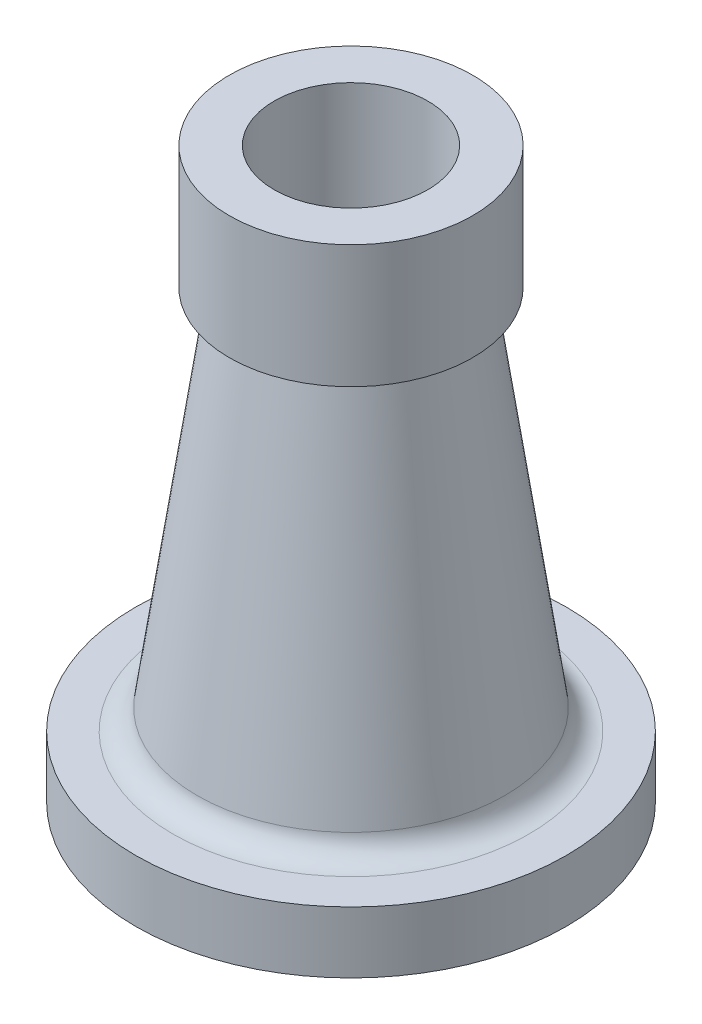
ISO-10303-21;
HEADER;
FILE_DESCRIPTION(('STEP AP214'),'2;1');
FILE_NAME('part.step','',(''),(''),'','','');
FILE_SCHEMA(('AUTOMOTIVE_DESIGN { 1 0 10303 214 1 1 1 1 }'));
ENDSEC;
DATA;
#1=APPLICATION_CONTEXT('core data for automotive mechanical design processes');
#2=APPLICATION_PROTOCOL_DEFINITION('international standard','automotive_design',2000,#1);
#3=PRODUCT_CONTEXT('',#1,'mechanical');
#4=PRODUCT('Part','Part','',(#3));
#5=PRODUCT_RELATED_PRODUCT_CATEGORY('part','',(#4));
#6=PRODUCT_DEFINITION_FORMATION('','',#4);
#7=PRODUCT_DEFINITION_CONTEXT('part definition',#1,'design');
#8=PRODUCT_DEFINITION('design','',#6,#7);
#9=PRODUCT_DEFINITION_SHAPE('','',#8);
#10=(LENGTH_UNIT() NAMED_UNIT(*) SI_UNIT(.MILLI.,.METRE.));
#11=(NAMED_UNIT(*) PLANE_ANGLE_UNIT() SI_UNIT($,.RADIAN.));
#12=(NAMED_UNIT(*) SI_UNIT($,.STERADIAN.) SOLID_ANGLE_UNIT());
#13=UNCERTAINTY_MEASURE_WITH_UNIT(LENGTH_MEASURE(1.E-05),#10,'distance_accuracy_value','');
#14=(GEOMETRIC_REPRESENTATION_CONTEXT(3) GLOBAL_UNCERTAINTY_ASSIGNED_CONTEXT((#13)) GLOBAL_UNIT_ASSIGNED_CONTEXT((#10,
#11,#12)) REPRESENTATION_CONTEXT('',''));
#15=CARTESIAN_POINT('',(0.,0.,0.));
#16=DIRECTION('',(0.,0.,1.));
#17=DIRECTION('',(1.,0.,0.));
#18=AXIS2_PLACEMENT_3D('',#15,#16,#17);
#19=CARTESIAN_POINT('',(0.,-96.2786807810246,0.));
#20=DIRECTION('',(0.,1.,0.));
#21=DIRECTION('',(0.,0.,1.));
#22=AXIS2_PLACEMENT_3D('',#19,#20,#21);
#23=TOROIDAL_SURFACE('',#22,57.9184382383119,7.99999999999999);
#24=CARTESIAN_POINT('',(0.,-97.4181262014115,0.));
#25=DIRECTION('',(0.,1.,0.));
#26=DIRECTION('',(0.,0.,1.));
#27=AXIS2_PLACEMENT_3D('',#24,#25,#26);
#28=CIRCLE('',#27,50.);
#29=CARTESIAN_POINT('',(0.,-97.4181262014115,50.));
#30=VERTEX_POINT('',#29);
#31=EDGE_CURVE('E77',#30,#30,#28,.T.);
#32=ORIENTED_EDGE('',*,*,#31,.F.);
#33=EDGE_LOOP('',(#32));
#34=FACE_BOUND('',#33,.T.);
#35=CARTESIAN_POINT('',(0.,-104.278680781025,0.));
#36=DIRECTION('',(0.,1.,0.));
#37=DIRECTION('',(0.,0.,1.));
#38=AXIS2_PLACEMENT_3D('',#35,#36,#37);
#39=CIRCLE('',#38,57.9184382383119);
#40=CARTESIAN_POINT('',(0.,-104.278680781025,57.9184382383119));
#41=VERTEX_POINT('',#40);
#42=EDGE_CURVE('E10',#41,#41,#39,.T.);
#43=ORIENTED_EDGE('',*,*,#42,.T.);
#44=EDGE_LOOP('',(#43));
#45=FACE_BOUND('',#44,.T.);
#46=ADVANCED_FACE('F31',(#34,#45),#23,.F.);
#47=CARTESIAN_POINT('',(57.9184382383119,-104.278680781025,0.));
#48=DIRECTION('',(0.,-1.,0.));
#49=DIRECTION('',(0.,0.,-1.));
#50=AXIS2_PLACEMENT_3D('',#47,#48,#49);
#51=PLANE('',#50);
#52=ORIENTED_EDGE('',*,*,#42,.F.);
#53=EDGE_LOOP('',(#52));
#54=FACE_BOUND('',#53,.T.);
#55=CARTESIAN_POINT('',(0.,-104.278680781025,0.));
#56=DIRECTION('',(0.,1.,0.));
#57=DIRECTION('',(0.,0.,1.));
#58=AXIS2_PLACEMENT_3D('',#55,#56,#57);
#59=CIRCLE('',#58,70.);
#60=CARTESIAN_POINT('',(0.,-104.278680781025,70.));
#61=VERTEX_POINT('',#60);
#62=EDGE_CURVE('E37',#61,#61,#59,.T.);
#63=ORIENTED_EDGE('',*,*,#62,.T.);
#64=EDGE_LOOP('',(#63));
#65=FACE_BOUND('',#64,.T.);
#66=ADVANCED_FACE('F84',(#54,#65),#51,.F.);
#67=CARTESIAN_POINT('',(0.,76.1737442525595,0.));
#68=DIRECTION('',(0.,1.,0.));
#69=DIRECTION('',(0.,0.,1.));
#70=AXIS2_PLACEMENT_3D('',#67,#68,#69);
#71=CYLINDRICAL_SURFACE('',#70,70.);
#72=ORIENTED_EDGE('',*,*,#62,.F.);
#73=EDGE_LOOP('',(#72));
#74=FACE_BOUND('',#73,.T.);
#75=CARTESIAN_POINT('',(0.,-124.278680781025,0.));
#76=DIRECTION('',(0.,1.,0.));
#77=DIRECTION('',(0.,0.,1.));
#78=AXIS2_PLACEMENT_3D('',#75,#76,#77);
#79=CIRCLE('',#78,70.);
#80=CARTESIAN_POINT('',(0.,-124.278680781025,70.));
#81=VERTEX_POINT('',#80);
#82=EDGE_CURVE('E41',#81,#81,#79,.T.);
#83=ORIENTED_EDGE('',*,*,#82,.T.);
#84=EDGE_LOOP('',(#83));
#85=FACE_BOUND('',#84,.T.);
#86=ADVANCED_FACE('F88',(#74,#85),#71,.T.);
#87=CARTESIAN_POINT('',(70.,-124.278680781025,0.));
#88=DIRECTION('',(0.,1.,0.));
#89=DIRECTION('',(0.,0.,1.));
#90=AXIS2_PLACEMENT_3D('',#87,#88,#89);
#91=PLANE('',#90);
#92=ORIENTED_EDGE('',*,*,#82,.F.);
#93=EDGE_LOOP('',(#92));
#94=FACE_BOUND('',#93,.T.);
#95=CARTESIAN_POINT('',(0.,-124.278680781025,0.));
#96=DIRECTION('',(0.,1.,0.));
#97=DIRECTION('',(0.,0.,1.));
#98=AXIS2_PLACEMENT_3D('',#95,#96,#97);
#99=CIRCLE('',#98,50.);
#100=CARTESIAN_POINT('',(0.,-124.278680781025,50.));
#101=VERTEX_POINT('',#100);
#102=EDGE_CURVE('E45',#101,#101,#99,.T.);
#103=ORIENTED_EDGE('',*,*,#102,.T.);
#104=EDGE_LOOP('',(#103));
#105=FACE_BOUND('',#104,.T.);
#106=ADVANCED_FACE('F93',(#94,#105),#91,.F.);
#107=CARTESIAN_POINT('',(0.,76.1737442525595,0.));
#108=DIRECTION('',(0.,1.,0.));
#109=DIRECTION('',(0.,0.,1.));
#110=AXIS2_PLACEMENT_3D('',#107,#108,#109);
#111=CYLINDRICAL_SURFACE('',#110,50.);
#112=ORIENTED_EDGE('',*,*,#102,.F.);
#113=EDGE_LOOP('',(#112));
#114=FACE_BOUND('',#113,.T.);
#115=CARTESIAN_POINT('',(0.,-122.278680781025,0.));
#116=DIRECTION('',(0.,1.,0.));
#117=DIRECTION('',(0.,0.,1.));
#118=AXIS2_PLACEMENT_3D('',#115,#116,#117);
#119=CIRCLE('',#118,50.);
#120=CARTESIAN_POINT('',(0.,-122.278680781025,50.));
#121=VERTEX_POINT('',#120);
#122=EDGE_CURVE('E50',#121,#121,#119,.T.);
#123=ORIENTED_EDGE('',*,*,#122,.T.);
#124=EDGE_LOOP('',(#123));
#125=FACE_BOUND('',#124,.T.);
#126=ADVANCED_FACE('F99',(#114,#125),#111,.F.);
#127=CARTESIAN_POINT('',(0.,-122.278680781025,0.));
#128=DIRECTION('',(0.,1.,0.));
#129=DIRECTION('',(0.,0.,1.));
#130=AXIS2_PLACEMENT_3D('',#127,#128,#129);
#131=TOROIDAL_SURFACE('',#130,49.,1.);
#132=ORIENTED_EDGE('',*,*,#122,.F.);
#133=EDGE_LOOP('',(#132));
#134=FACE_BOUND('',#133,.T.);
#135=CARTESIAN_POINT('',(0.,-121.278680781025,0.));
#136=DIRECTION('',(0.,1.,0.));
#137=DIRECTION('',(0.,0.,1.));
#138=AXIS2_PLACEMENT_3D('',#135,#136,#137);
#139=CIRCLE('',#138,49.);
#140=CARTESIAN_POINT('',(0.,-121.278680781025,49.));
#141=VERTEX_POINT('',#140);
#142=EDGE_CURVE('E53',#141,#141,#139,.T.);
#143=ORIENTED_EDGE('',*,*,#142,.T.);
#144=EDGE_LOOP('',(#143));
#145=FACE_BOUND('',#144,.T.);
#146=ADVANCED_FACE('F103',(#134,#145),#131,.F.);
#147=CARTESIAN_POINT('',(43.3304777069742,-121.278680781025,0.));
#148=DIRECTION('',(0.,1.,0.));
#149=DIRECTION('',(0.,0.,1.));
#150=AXIS2_PLACEMENT_3D('',#147,#148,#149);
#151=PLANE('',#150);
#152=ORIENTED_EDGE('',*,*,#142,.F.);
#153=EDGE_LOOP('',(#152));
#154=FACE_BOUND('',#153,.T.);
#155=CARTESIAN_POINT('',(0.,-121.278680781025,0.));
#156=DIRECTION('',(0.,1.,0.));
#157=DIRECTION('',(0.,0.,1.));
#158=AXIS2_PLACEMENT_3D('',#155,#156,#157);
#159=CIRCLE('',#158,43.3304777069742);
#160=CARTESIAN_POINT('',(0.,-121.278680781025,43.3304777069742));
#161=VERTEX_POINT('',#160);
#162=EDGE_CURVE('E56',#161,#161,#159,.T.);
#163=ORIENTED_EDGE('',*,*,#162,.T.);
#164=EDGE_LOOP('',(#163));
#165=FACE_BOUND('',#164,.T.);
#166=ADVANCED_FACE('F107',(#154,#165),#151,.F.);
#167=CARTESIAN_POINT('',(0.,6.10675866560406,0.));
#168=DIRECTION('',(0.,-1.,0.));
#169=DIRECTION('',(0.,0.,-1.));
#170=AXIS2_PLACEMENT_3D('',#167,#168,#169);
#171=CONICAL_SURFACE('',#170,25.,0.142916697533729);
#172=ORIENTED_EDGE('',*,*,#162,.F.);
#173=EDGE_LOOP('',(#172));
#174=FACE_BOUND('',#173,.T.);
#175=CARTESIAN_POINT('',(0.,6.10675866560406,0.));
#176=DIRECTION('',(0.,1.,0.));
#177=DIRECTION('',(0.,0.,1.));
#178=AXIS2_PLACEMENT_3D('',#175,#176,#177);
#179=CIRCLE('',#178,25.);
#180=CARTESIAN_POINT('',(0.,6.10675866560406,25.));
#181=VERTEX_POINT('',#180);
#182=EDGE_CURVE('E59',#181,#181,#179,.T.);
#183=ORIENTED_EDGE('',*,*,#182,.T.);
#184=EDGE_LOOP('',(#183));
#185=FACE_BOUND('',#184,.T.);
#186=ADVANCED_FACE('F111',(#174,#185),#171,.F.);
#187=CARTESIAN_POINT('',(0.,76.1737442525595,0.));
#188=DIRECTION('',(0.,1.,0.));
#189=DIRECTION('',(0.,0.,1.));
#190=AXIS2_PLACEMENT_3D('',#187,#188,#189);
#191=CYLINDRICAL_SURFACE('',#190,25.);
#192=ORIENTED_EDGE('',*,*,#182,.F.);
#193=EDGE_LOOP('',(#192));
#194=FACE_BOUND('',#193,.T.);
#195=CARTESIAN_POINT('',(0.,60.7213192189753,0.));
#196=DIRECTION('',(0.,1.,0.));
#197=DIRECTION('',(0.,0.,1.));
#198=AXIS2_PLACEMENT_3D('',#195,#196,#197);
#199=CIRCLE('',#198,25.);
#200=CARTESIAN_POINT('',(0.,60.7213192189753,25.));
#201=VERTEX_POINT('',#200);
#202=EDGE_CURVE('E62',#201,#201,#199,.T.);
#203=ORIENTED_EDGE('',*,*,#202,.T.);
#204=EDGE_LOOP('',(#203));
#205=FACE_BOUND('',#204,.T.);
#206=ADVANCED_FACE('F115',(#194,#205),#191,.F.);
#207=CARTESIAN_POINT('',(39.5878595746606,60.7213192189753,0.));
#208=DIRECTION('',(0.,-1.,0.));
#209=DIRECTION('',(0.,0.,-1.));
#210=AXIS2_PLACEMENT_3D('',#207,#208,#209);
#211=PLANE('',#210);
#212=ORIENTED_EDGE('',*,*,#202,.F.);
#213=EDGE_LOOP('',(#212));
#214=FACE_BOUND('',#213,.T.);
#215=CARTESIAN_POINT('',(0.,60.7213192189753,0.));
#216=DIRECTION('',(0.,1.,0.));
#217=DIRECTION('',(0.,0.,1.));
#218=AXIS2_PLACEMENT_3D('',#215,#216,#217);
#219=CIRCLE('',#218,39.5878595746606);
#220=CARTESIAN_POINT('',(0.,60.7213192189753,39.5878595746606));
#221=VERTEX_POINT('',#220);
#222=EDGE_CURVE('E65',#221,#221,#219,.T.);
#223=ORIENTED_EDGE('',*,*,#222,.T.);
#224=EDGE_LOOP('',(#223));
#225=FACE_BOUND('',#224,.T.);
#226=ADVANCED_FACE('F119',(#214,#225),#211,.F.);
#227=CARTESIAN_POINT('',(0.,76.1737442525595,0.));
#228=DIRECTION('',(0.,1.,0.));
#229=DIRECTION('',(0.,0.,1.));
#230=AXIS2_PLACEMENT_3D('',#227,#228,#229);
#231=CYLINDRICAL_SURFACE('',#230,39.5878595746607);
#232=ORIENTED_EDGE('',*,*,#222,.F.);
#233=EDGE_LOOP('',(#232));
#234=FACE_BOUND('',#233,.T.);
#235=CARTESIAN_POINT('',(0.,20.7213192189753,0.));
#236=DIRECTION('',(0.,1.,0.));
#237=DIRECTION('',(0.,0.,1.));
#238=AXIS2_PLACEMENT_3D('',#235,#236,#237);
#239=CIRCLE('',#238,39.5878595746607);
#240=CARTESIAN_POINT('',(0.,20.7213192189753,39.5878595746607));
#241=VERTEX_POINT('',#240);
#242=EDGE_CURVE('E68',#241,#241,#239,.T.);
#243=ORIENTED_EDGE('',*,*,#242,.T.);
#244=EDGE_LOOP('',(#243));
#245=FACE_BOUND('',#244,.T.);
#246=ADVANCED_FACE('F123',(#234,#245),#231,.T.);
#247=CARTESIAN_POINT('',(39.5878595746607,20.7213192189753,0.));
#248=DIRECTION('',(0.,1.,0.));
#249=DIRECTION('',(0.,0.,1.));
#250=AXIS2_PLACEMENT_3D('',#247,#248,#249);
#251=PLANE('',#250);
#252=ORIENTED_EDGE('',*,*,#242,.F.);
#253=EDGE_LOOP('',(#252));
#254=FACE_BOUND('',#253,.T.);
#255=CARTESIAN_POINT('',(0.,20.7213192189753,0.));
#256=DIRECTION('',(0.,1.,0.));
#257=DIRECTION('',(0.,0.,1.));
#258=AXIS2_PLACEMENT_3D('',#255,#256,#257);
#259=CIRCLE('',#258,34.1541979801228);
#260=CARTESIAN_POINT('',(0.,20.7213192189753,34.1541979801228));
#261=VERTEX_POINT('',#260);
#262=EDGE_CURVE('E71',#261,#261,#259,.T.);
#263=ORIENTED_EDGE('',*,*,#262,.T.);
#264=EDGE_LOOP('',(#263));
#265=FACE_BOUND('',#264,.T.);
#266=ADVANCED_FACE('F127',(#254,#265),#251,.F.);
#267=CARTESIAN_POINT('',(0.,19.7213192189753,0.));
#268=DIRECTION('',(0.,1.,0.));
#269=DIRECTION('',(0.,0.,1.));
#270=AXIS2_PLACEMENT_3D('',#267,#268,#269);
#271=TOROIDAL_SURFACE('',#270,34.1541979801228,0.999999999999996);
#272=ORIENTED_EDGE('',*,*,#262,.F.);
#273=EDGE_LOOP('',(#272));
#274=FACE_BOUND('',#273,.T.);
#275=CARTESIAN_POINT('',(0.,19.578888541427,0.));
#276=DIRECTION('',(0.,1.,0.));
#277=DIRECTION('',(0.,0.,1.));
#278=AXIS2_PLACEMENT_3D('',#275,#276,#277);
#279=CIRCLE('',#278,33.1643932003338);
#280=CARTESIAN_POINT('',(0.,19.578888541427,33.1643932003338));
#281=VERTEX_POINT('',#280);
#282=EDGE_CURVE('E74',#281,#281,#279,.T.);
#283=ORIENTED_EDGE('',*,*,#282,.T.);
#284=EDGE_LOOP('',(#283));
#285=FACE_BOUND('',#284,.T.);
#286=ADVANCED_FACE('F131',(#274,#285),#271,.F.);
#287=CARTESIAN_POINT('',(0.,-97.4181262014115,0.));
#288=DIRECTION('',(0.,-1.,0.));
#289=DIRECTION('',(0.,0.,-1.));
#290=AXIS2_PLACEMENT_3D('',#287,#288,#289);
#291=CONICAL_SURFACE('',#290,50.,0.142916697533729);
#292=ORIENTED_EDGE('',*,*,#282,.F.);
#293=EDGE_LOOP('',(#292));
#294=FACE_BOUND('',#293,.T.);
#295=ORIENTED_EDGE('',*,*,#31,.T.);
#296=EDGE_LOOP('',(#295));
#297=FACE_BOUND('',#296,.T.);
#298=ADVANCED_FACE('F81',(#294,#297),#291,.T.);
#299=CLOSED_SHELL('',(#46,#66,#86,#106,#126,#146,#166,#186,#206,#226,#246,#266,#286,#298));
#300=MANIFOLD_SOLID_BREP('B2',#299);
#301=ADVANCED_BREP_SHAPE_REPRESENTATION('',(#18,#300),#14);
#302=SHAPE_DEFINITION_REPRESENTATION(#9,#301);
ENDSEC;
END-ISO-10303-21;
